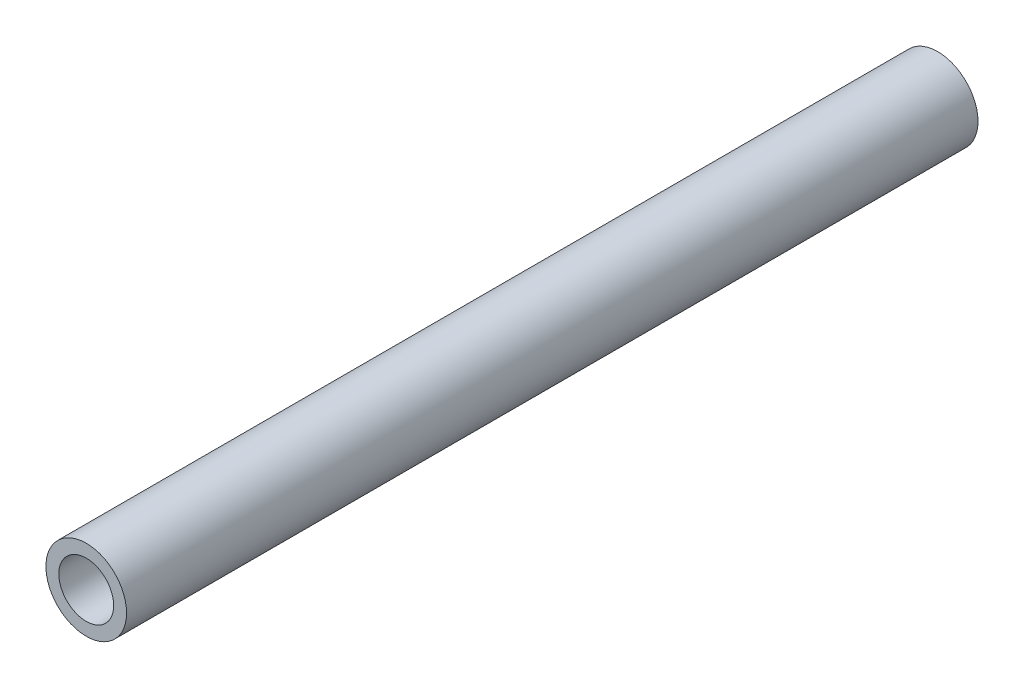
ISO-10303-21;
HEADER;
FILE_DESCRIPTION(('STEP AP214'),'2;1');
FILE_NAME('part.step','',(''),(''),'','','');
FILE_SCHEMA(('AUTOMOTIVE_DESIGN { 1 0 10303 214 1 1 1 1 }'));
ENDSEC;
DATA;
#1=APPLICATION_CONTEXT('core data for automotive mechanical design processes');
#2=APPLICATION_PROTOCOL_DEFINITION('international standard','automotive_design',2000,#1);
#3=PRODUCT_CONTEXT('',#1,'mechanical');
#4=PRODUCT('Part','Part','',(#3));
#5=PRODUCT_RELATED_PRODUCT_CATEGORY('part','',(#4));
#6=PRODUCT_DEFINITION_FORMATION('','',#4);
#7=PRODUCT_DEFINITION_CONTEXT('part definition',#1,'design');
#8=PRODUCT_DEFINITION('design','',#6,#7);
#9=PRODUCT_DEFINITION_SHAPE('','',#8);
#10=(LENGTH_UNIT() NAMED_UNIT(*) SI_UNIT(.MILLI.,.METRE.));
#11=(NAMED_UNIT(*) PLANE_ANGLE_UNIT() SI_UNIT($,.RADIAN.));
#12=(NAMED_UNIT(*) SI_UNIT($,.STERADIAN.) SOLID_ANGLE_UNIT());
#13=UNCERTAINTY_MEASURE_WITH_UNIT(LENGTH_MEASURE(1.E-05),#10,'distance_accuracy_value','');
#14=(GEOMETRIC_REPRESENTATION_CONTEXT(3) GLOBAL_UNCERTAINTY_ASSIGNED_CONTEXT((#13)) GLOBAL_UNIT_ASSIGNED_CONTEXT((#10,
#11,#12)) REPRESENTATION_CONTEXT('',''));
#15=CARTESIAN_POINT('',(0.,0.,0.));
#16=DIRECTION('',(0.,0.,1.));
#17=DIRECTION('',(1.,0.,0.));
#18=AXIS2_PLACEMENT_3D('',#15,#16,#17);
#19=CARTESIAN_POINT('',(-29.5997697253601,13.8632701020498,132.));
#20=DIRECTION('',(0.,0.,1.));
#21=DIRECTION('',(1.,0.,0.));
#22=AXIS2_PLACEMENT_3D('',#19,#20,#21);
#23=PLANE('',#22);
#24=CARTESIAN_POINT('',(-29.5997697253601,13.8632701020498,132.));
#25=DIRECTION('',(0.,0.,1.));
#26=DIRECTION('',(1.,0.,0.));
#27=AXIS2_PLACEMENT_3D('',#24,#25,#26);
#28=CIRCLE('',#27,6.25);
#29=CARTESIAN_POINT('',(-23.3497697253601,13.8632701020498,132.));
#30=VERTEX_POINT('',#29);
#31=EDGE_CURVE('E10',#30,#30,#28,.T.);
#32=ORIENTED_EDGE('',*,*,#31,.T.);
#33=EDGE_LOOP('',(#32));
#34=FACE_BOUND('',#33,.T.);
#35=CARTESIAN_POINT('',(-29.5997697253601,13.8632701020498,132.));
#36=DIRECTION('',(0.,0.,1.));
#37=DIRECTION('',(1.,0.,0.));
#38=AXIS2_PLACEMENT_3D('',#35,#36,#37);
#39=CIRCLE('',#38,4.25);
#40=CARTESIAN_POINT('',(-25.3497697253601,13.8632701020498,132.));
#41=VERTEX_POINT('',#40);
#42=EDGE_CURVE('E50',#41,#41,#39,.T.);
#43=ORIENTED_EDGE('',*,*,#42,.F.);
#44=EDGE_LOOP('',(#43));
#45=FACE_BOUND('',#44,.T.);
#46=ADVANCED_FACE('F37',(#34,#45),#23,.T.);
#47=CARTESIAN_POINT('',(-29.5997697253601,13.8632701020498,0.));
#48=DIRECTION('',(0.,0.,1.));
#49=DIRECTION('',(1.,0.,0.));
#50=AXIS2_PLACEMENT_3D('',#47,#48,#49);
#51=PLANE('',#50);
#52=CARTESIAN_POINT('',(-29.5997697253601,13.8632701020498,0.));
#53=DIRECTION('',(0.,0.,1.));
#54=DIRECTION('',(1.,0.,0.));
#55=AXIS2_PLACEMENT_3D('',#52,#53,#54);
#56=CIRCLE('',#55,6.25);
#57=CARTESIAN_POINT('',(-23.3497697253601,13.8632701020498,0.));
#58=VERTEX_POINT('',#57);
#59=EDGE_CURVE('E41',#58,#58,#56,.T.);
#60=ORIENTED_EDGE('',*,*,#59,.F.);
#61=EDGE_LOOP('',(#60));
#62=FACE_BOUND('',#61,.T.);
#63=CARTESIAN_POINT('',(-29.5997697253601,13.8632701020498,0.));
#64=DIRECTION('',(0.,0.,1.));
#65=DIRECTION('',(1.,0.,0.));
#66=AXIS2_PLACEMENT_3D('',#63,#64,#65);
#67=CIRCLE('',#66,4.25);
#68=CARTESIAN_POINT('',(-25.3497697253601,13.8632701020498,0.));
#69=VERTEX_POINT('',#68);
#70=EDGE_CURVE('E52',#69,#69,#67,.T.);
#71=ORIENTED_EDGE('',*,*,#70,.T.);
#72=EDGE_LOOP('',(#71));
#73=FACE_BOUND('',#72,.T.);
#74=ADVANCED_FACE('F64',(#62,#73),#51,.F.);
#75=CARTESIAN_POINT('',(-29.5997697253601,13.8632701020498,132.));
#76=DIRECTION('',(0.,0.,-1.));
#77=DIRECTION('',(-1.,0.,0.));
#78=AXIS2_PLACEMENT_3D('',#75,#76,#77);
#79=CYLINDRICAL_SURFACE('',#78,6.25);
#80=ORIENTED_EDGE('',*,*,#31,.F.);
#81=EDGE_LOOP('',(#80));
#82=FACE_BOUND('',#81,.T.);
#83=ORIENTED_EDGE('',*,*,#59,.T.);
#84=EDGE_LOOP('',(#83));
#85=FACE_BOUND('',#84,.T.);
#86=ADVANCED_FACE('F39',(#82,#85),#79,.T.);
#87=CARTESIAN_POINT('',(-29.5997697253601,13.8632701020498,132.));
#88=DIRECTION('',(0.,0.,-1.));
#89=DIRECTION('',(-1.,0.,0.));
#90=AXIS2_PLACEMENT_3D('',#87,#88,#89);
#91=CYLINDRICAL_SURFACE('',#90,4.25);
#92=ORIENTED_EDGE('',*,*,#42,.T.);
#93=EDGE_LOOP('',(#92));
#94=FACE_BOUND('',#93,.T.);
#95=ORIENTED_EDGE('',*,*,#70,.F.);
#96=EDGE_LOOP('',(#95));
#97=FACE_BOUND('',#96,.T.);
#98=ADVANCED_FACE('F60',(#94,#97),#91,.F.);
#99=CLOSED_SHELL('',(#46,#74,#86,#98));
#100=MANIFOLD_SOLID_BREP('B2',#99);
#101=ADVANCED_BREP_SHAPE_REPRESENTATION('',(#18,#100),#14);
#102=SHAPE_DEFINITION_REPRESENTATION(#9,#101);
ENDSEC;
END-ISO-10303-21;
